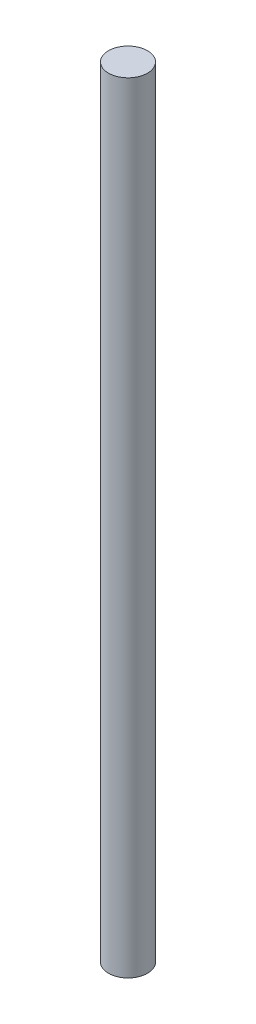
ISO-10303-21;
HEADER;
FILE_DESCRIPTION(('STEP AP214'),'2;1');
FILE_NAME('part.step','',(''),(''),'','','');
FILE_SCHEMA(('AUTOMOTIVE_DESIGN { 1 0 10303 214 1 1 1 1 }'));
ENDSEC;
DATA;
#1=APPLICATION_CONTEXT('core data for automotive mechanical design processes');
#2=APPLICATION_PROTOCOL_DEFINITION('international standard','automotive_design',2000,#1);
#3=PRODUCT_CONTEXT('',#1,'mechanical');
#4=PRODUCT('Part','Part','',(#3));
#5=PRODUCT_RELATED_PRODUCT_CATEGORY('part','',(#4));
#6=PRODUCT_DEFINITION_FORMATION('','',#4);
#7=PRODUCT_DEFINITION_CONTEXT('part definition',#1,'design');
#8=PRODUCT_DEFINITION('design','',#6,#7);
#9=PRODUCT_DEFINITION_SHAPE('','',#8);
#10=(LENGTH_UNIT() NAMED_UNIT(*) SI_UNIT(.MILLI.,.METRE.));
#11=(NAMED_UNIT(*) PLANE_ANGLE_UNIT() SI_UNIT($,.RADIAN.));
#12=(NAMED_UNIT(*) SI_UNIT($,.STERADIAN.) SOLID_ANGLE_UNIT());
#13=UNCERTAINTY_MEASURE_WITH_UNIT(LENGTH_MEASURE(1.E-05),#10,'distance_accuracy_value','');
#14=(GEOMETRIC_REPRESENTATION_CONTEXT(3) GLOBAL_UNCERTAINTY_ASSIGNED_CONTEXT((#13)) GLOBAL_UNIT_ASSIGNED_CONTEXT((#10,
#11,#12)) REPRESENTATION_CONTEXT('',''));
#15=CARTESIAN_POINT('',(0.,0.,0.));
#16=DIRECTION('',(0.,0.,1.));
#17=DIRECTION('',(1.,0.,0.));
#18=AXIS2_PLACEMENT_3D('',#15,#16,#17);
#19=CARTESIAN_POINT('',(0.,508.,0.));
#20=DIRECTION('',(0.,-1.,0.));
#21=DIRECTION('',(0.,0.,-1.));
#22=AXIS2_PLACEMENT_3D('',#19,#20,#21);
#23=CYLINDRICAL_SURFACE('',#22,12.7);
#24=CARTESIAN_POINT('',(0.,508.,0.));
#25=DIRECTION('',(0.,1.,0.));
#26=DIRECTION('',(0.,0.,1.));
#27=AXIS2_PLACEMENT_3D('',#24,#25,#26);
#28=CIRCLE('',#27,12.7);
#29=CARTESIAN_POINT('',(0.,508.,12.7));
#30=VERTEX_POINT('',#29);
#31=EDGE_CURVE('E10',#30,#30,#28,.T.);
#32=ORIENTED_EDGE('',*,*,#31,.F.);
#33=EDGE_LOOP('',(#32));
#34=FACE_BOUND('',#33,.T.);
#35=CARTESIAN_POINT('',(0.,0.,0.));
#36=DIRECTION('',(0.,1.,0.));
#37=DIRECTION('',(0.,0.,1.));
#38=AXIS2_PLACEMENT_3D('',#35,#36,#37);
#39=CIRCLE('',#38,12.7);
#40=CARTESIAN_POINT('',(0.,0.,12.7));
#41=VERTEX_POINT('',#40);
#42=EDGE_CURVE('E34',#41,#41,#39,.T.);
#43=ORIENTED_EDGE('',*,*,#42,.T.);
#44=EDGE_LOOP('',(#43));
#45=FACE_BOUND('',#44,.T.);
#46=ADVANCED_FACE('F31',(#34,#45),#23,.T.);
#47=CARTESIAN_POINT('',(0.,508.,0.));
#48=DIRECTION('',(0.,1.,0.));
#49=DIRECTION('',(0.,0.,1.));
#50=AXIS2_PLACEMENT_3D('',#47,#48,#49);
#51=PLANE('',#50);
#52=ORIENTED_EDGE('',*,*,#31,.T.);
#53=EDGE_LOOP('',(#52));
#54=FACE_BOUND('',#53,.T.);
#55=ADVANCED_FACE('F46',(#54),#51,.T.);
#56=CARTESIAN_POINT('',(0.,0.,0.));
#57=DIRECTION('',(0.,1.,0.));
#58=DIRECTION('',(0.,0.,1.));
#59=AXIS2_PLACEMENT_3D('',#56,#57,#58);
#60=PLANE('',#59);
#61=ORIENTED_EDGE('',*,*,#42,.F.);
#62=EDGE_LOOP('',(#61));
#63=FACE_BOUND('',#62,.T.);
#64=ADVANCED_FACE('F44',(#63),#60,.F.);
#65=CLOSED_SHELL('',(#46,#55,#64));
#66=MANIFOLD_SOLID_BREP('B2',#65);
#67=ADVANCED_BREP_SHAPE_REPRESENTATION('',(#18,#66),#14);
#68=SHAPE_DEFINITION_REPRESENTATION(#9,#67);
ENDSEC;
END-ISO-10303-21;
